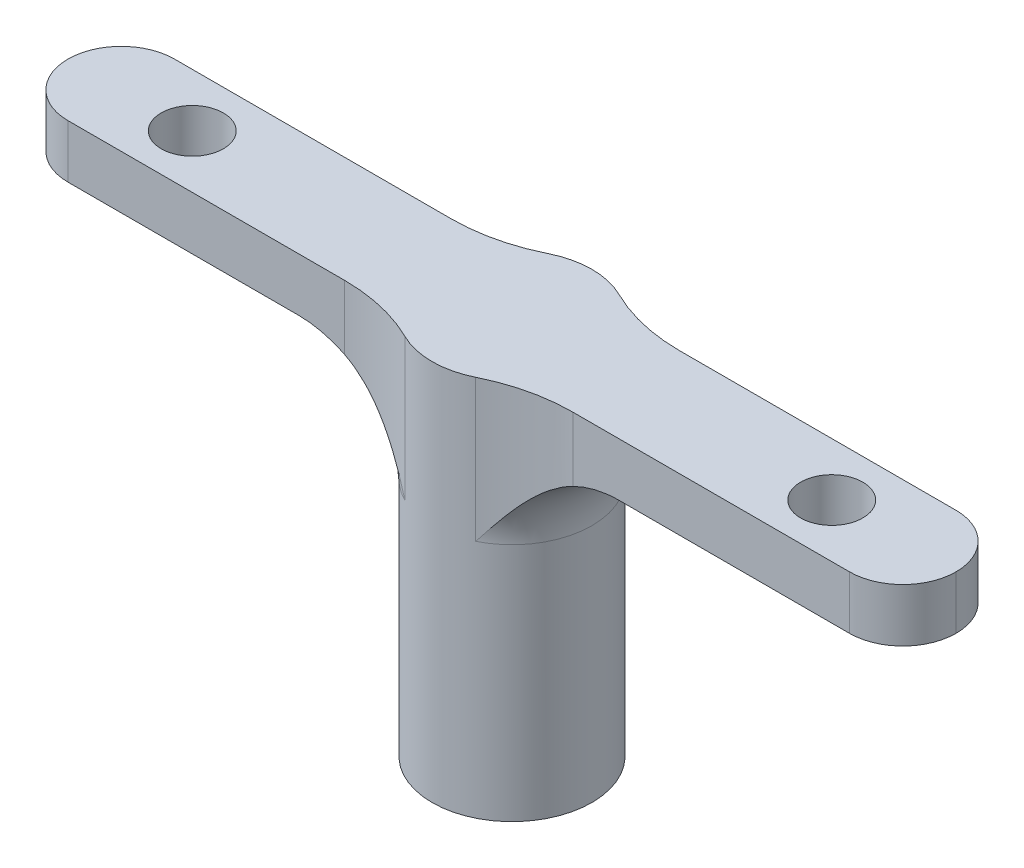
ISO-10303-21;
HEADER;
FILE_DESCRIPTION(('STEP AP214'),'2;1');
FILE_NAME('part.step','',(''),(''),'','','');
FILE_SCHEMA(('AUTOMOTIVE_DESIGN { 1 0 10303 214 1 1 1 1 }'));
ENDSEC;
DATA;
#1=APPLICATION_CONTEXT('core data for automotive mechanical design processes');
#2=APPLICATION_PROTOCOL_DEFINITION('international standard','automotive_design',2000,#1);
#3=PRODUCT_CONTEXT('',#1,'mechanical');
#4=PRODUCT('Part','Part','',(#3));
#5=PRODUCT_RELATED_PRODUCT_CATEGORY('part','',(#4));
#6=PRODUCT_DEFINITION_FORMATION('','',#4);
#7=PRODUCT_DEFINITION_CONTEXT('part definition',#1,'design');
#8=PRODUCT_DEFINITION('design','',#6,#7);
#9=PRODUCT_DEFINITION_SHAPE('','',#8);
#10=(LENGTH_UNIT() NAMED_UNIT(*) SI_UNIT(.MILLI.,.METRE.));
#11=(NAMED_UNIT(*) PLANE_ANGLE_UNIT() SI_UNIT($,.RADIAN.));
#12=(NAMED_UNIT(*) SI_UNIT($,.STERADIAN.) SOLID_ANGLE_UNIT());
#13=UNCERTAINTY_MEASURE_WITH_UNIT(LENGTH_MEASURE(1.E-05),#10,'distance_accuracy_value','');
#14=(GEOMETRIC_REPRESENTATION_CONTEXT(3) GLOBAL_UNCERTAINTY_ASSIGNED_CONTEXT((#13)) GLOBAL_UNIT_ASSIGNED_CONTEXT((#10,
#11,#12)) REPRESENTATION_CONTEXT('',''));
#15=CARTESIAN_POINT('',(0.,0.,0.));
#16=DIRECTION('',(0.,0.,1.));
#17=DIRECTION('',(1.,0.,0.));
#18=AXIS2_PLACEMENT_3D('',#15,#16,#17);
#19=CARTESIAN_POINT('',(0.,21.5,0.));
#20=DIRECTION('',(0.,1.,0.));
#21=DIRECTION('',(0.,0.,1.));
#22=AXIS2_PLACEMENT_3D('',#19,#20,#21);
#23=PLANE('',#22);
#24=CARTESIAN_POINT('',(-22.,21.5,0.));
#25=DIRECTION('',(0.,1.,0.));
#26=DIRECTION('',(0.,0.,1.));
#27=AXIS2_PLACEMENT_3D('',#24,#25,#26);
#28=CIRCLE('',#27,3.);
#29=CARTESIAN_POINT('',(-22.,21.5,-3.));
#30=VERTEX_POINT('',#29);
#31=CARTESIAN_POINT('',(-25.,21.5,0.));
#32=VERTEX_POINT('',#31);
#33=EDGE_CURVE('E207',#30,#32,#28,.T.);
#34=ORIENTED_EDGE('',*,*,#33,.T.);
#35=CARTESIAN_POINT('',(-22.,21.5,0.));
#36=DIRECTION('',(0.,1.,0.));
#37=DIRECTION('',(0.,0.,1.));
#38=AXIS2_PLACEMENT_3D('',#35,#36,#37);
#39=CIRCLE('',#38,3.);
#40=CARTESIAN_POINT('',(-22.,21.5,3.));
#41=VERTEX_POINT('',#40);
#42=EDGE_CURVE('E210',#32,#41,#39,.T.);
#43=ORIENTED_EDGE('',*,*,#42,.T.);
#44=DIRECTION('',(-1.,0.,0.));
#45=VECTOR('',#44,1.);
#46=CARTESIAN_POINT('',(0.,21.5,3.00000000000001));
#47=LINE('',#46,#45);
#48=CARTESIAN_POINT('',(-6.42261628933255,21.5,3.00000000000001));
#49=VERTEX_POINT('',#48);
#50=EDGE_CURVE('E189',#49,#41,#47,.T.);
#51=ORIENTED_EDGE('',*,*,#50,.F.);
#52=CARTESIAN_POINT('',(-6.42261628933255,21.5,13.));
#53=DIRECTION('',(0.,1.,0.));
#54=DIRECTION('',(0.,0.,1.));
#55=AXIS2_PLACEMENT_3D('',#52,#53,#54);
#56=CIRCLE('',#55,10.);
#57=CARTESIAN_POINT('',(-1.99322574496528,21.5,4.03448275862069));
#58=VERTEX_POINT('',#57);
#59=EDGE_CURVE('E388',#49,#58,#56,.F.);
#60=ORIENTED_EDGE('',*,*,#59,.T.);
#61=CARTESIAN_POINT('',(0.,21.5,0.));
#62=DIRECTION('',(0.,1.,0.));
#63=DIRECTION('',(0.,0.,1.));
#64=AXIS2_PLACEMENT_3D('',#61,#62,#63);
#65=CIRCLE('',#64,4.5);
#66=CARTESIAN_POINT('',(1.99322574496527,21.5,4.03448275862069));
#67=VERTEX_POINT('',#66);
#68=EDGE_CURVE('E432',#58,#67,#65,.T.);
#69=ORIENTED_EDGE('',*,*,#68,.T.);
#70=CARTESIAN_POINT('',(6.42261628933255,21.5,13.));
#71=DIRECTION('',(0.,1.,0.));
#72=DIRECTION('',(0.,0.,1.));
#73=AXIS2_PLACEMENT_3D('',#70,#71,#72);
#74=CIRCLE('',#73,10.);
#75=CARTESIAN_POINT('',(6.42261628933255,21.5,3.00000000000001));
#76=VERTEX_POINT('',#75);
#77=EDGE_CURVE('E371',#67,#76,#74,.F.);
#78=ORIENTED_EDGE('',*,*,#77,.T.);
#79=DIRECTION('',(-1.,0.,0.));
#80=VECTOR('',#79,1.);
#81=CARTESIAN_POINT('',(0.,21.5,3.00000000000001));
#82=LINE('',#81,#80);
#83=CARTESIAN_POINT('',(22.,21.5,3.00000000000001));
#84=VERTEX_POINT('',#83);
#85=EDGE_CURVE('E442',#84,#76,#82,.T.);
#86=ORIENTED_EDGE('',*,*,#85,.F.);
#87=CARTESIAN_POINT('',(22.,21.5,0.));
#88=DIRECTION('',(0.,1.,0.));
#89=DIRECTION('',(0.,0.,1.));
#90=AXIS2_PLACEMENT_3D('',#87,#88,#89);
#91=CIRCLE('',#90,3.);
#92=CARTESIAN_POINT('',(25.,21.5,0.));
#93=VERTEX_POINT('',#92);
#94=EDGE_CURVE('E204',#84,#93,#91,.T.);
#95=ORIENTED_EDGE('',*,*,#94,.T.);
#96=CARTESIAN_POINT('',(22.,21.5,0.));
#97=DIRECTION('',(0.,1.,0.));
#98=DIRECTION('',(0.,0.,1.));
#99=AXIS2_PLACEMENT_3D('',#96,#97,#98);
#100=CIRCLE('',#99,3.);
#101=CARTESIAN_POINT('',(22.,21.5,-3.00000000000001));
#102=VERTEX_POINT('',#101);
#103=EDGE_CURVE('E184',#93,#102,#100,.T.);
#104=ORIENTED_EDGE('',*,*,#103,.T.);
#105=DIRECTION('',(-1.,0.,0.));
#106=VECTOR('',#105,1.);
#107=CARTESIAN_POINT('',(0.,21.5,-3.00000000000001));
#108=LINE('',#107,#106);
#109=CARTESIAN_POINT('',(6.42261628933255,21.5,-3.00000000000001));
#110=VERTEX_POINT('',#109);
#111=EDGE_CURVE('E446',#102,#110,#108,.T.);
#112=ORIENTED_EDGE('',*,*,#111,.T.);
#113=CARTESIAN_POINT('',(6.42261628933255,21.5,-13.));
#114=DIRECTION('',(0.,1.,0.));
#115=DIRECTION('',(0.,0.,1.));
#116=AXIS2_PLACEMENT_3D('',#113,#114,#115);
#117=CIRCLE('',#116,10.);
#118=CARTESIAN_POINT('',(1.99322574496527,21.5,-4.03448275862069));
#119=VERTEX_POINT('',#118);
#120=EDGE_CURVE('E359',#110,#119,#117,.F.);
#121=ORIENTED_EDGE('',*,*,#120,.T.);
#122=CARTESIAN_POINT('',(0.,21.5,0.));
#123=DIRECTION('',(0.,1.,0.));
#124=DIRECTION('',(0.,0.,1.));
#125=AXIS2_PLACEMENT_3D('',#122,#123,#124);
#126=CIRCLE('',#125,4.5);
#127=CARTESIAN_POINT('',(-1.99322574496528,21.5,-4.03448275862069));
#128=VERTEX_POINT('',#127);
#129=EDGE_CURVE('E450',#119,#128,#126,.T.);
#130=ORIENTED_EDGE('',*,*,#129,.T.);
#131=CARTESIAN_POINT('',(-6.42261628933255,21.5,-13.));
#132=DIRECTION('',(0.,1.,0.));
#133=DIRECTION('',(0.,0.,1.));
#134=AXIS2_PLACEMENT_3D('',#131,#132,#133);
#135=CIRCLE('',#134,10.);
#136=CARTESIAN_POINT('',(-6.42261628933255,21.5,-3.00000000000001));
#137=VERTEX_POINT('',#136);
#138=EDGE_CURVE('E11',#128,#137,#135,.F.);
#139=ORIENTED_EDGE('',*,*,#138,.T.);
#140=DIRECTION('',(-1.,0.,0.));
#141=VECTOR('',#140,1.);
#142=CARTESIAN_POINT('',(0.,21.5,-3.00000000000001));
#143=LINE('',#142,#141);
#144=EDGE_CURVE('E424',#137,#30,#143,.T.);
#145=ORIENTED_EDGE('',*,*,#144,.T.);
#146=EDGE_LOOP('',(#34,#43,#51,#60,#69,#78,#86,#95,#104,#112,#121,#130,#139,#145));
#147=FACE_BOUND('',#146,.T.);
#148=CARTESIAN_POINT('',(18.,21.5,0.));
#149=DIRECTION('',(0.,1.,0.));
#150=DIRECTION('',(0.,0.,1.));
#151=AXIS2_PLACEMENT_3D('',#148,#149,#150);
#152=CIRCLE('',#151,1.75);
#153=CARTESIAN_POINT('',(18.,21.5,1.75));
#154=VERTEX_POINT('',#153);
#155=EDGE_CURVE('E724',#154,#154,#152,.T.);
#156=ORIENTED_EDGE('',*,*,#155,.F.);
#157=EDGE_LOOP('',(#156));
#158=FACE_BOUND('',#157,.T.);
#159=CARTESIAN_POINT('',(-18.,21.5,0.));
#160=DIRECTION('',(0.,1.,0.));
#161=DIRECTION('',(0.,0.,1.));
#162=AXIS2_PLACEMENT_3D('',#159,#160,#161);
#163=CIRCLE('',#162,1.75);
#164=CARTESIAN_POINT('',(-18.,21.5,1.75));
#165=VERTEX_POINT('',#164);
#166=EDGE_CURVE('E719',#165,#165,#163,.F.);
#167=ORIENTED_EDGE('',*,*,#166,.T.);
#168=EDGE_LOOP('',(#167));
#169=FACE_BOUND('',#168,.T.);
#170=ADVANCED_FACE('F44',(#147,#158,#169),#23,.T.);
#171=CARTESIAN_POINT('',(0.,18.5,0.));
#172=DIRECTION('',(0.,-1.,0.));
#173=DIRECTION('',(0.,0.,-1.));
#174=AXIS2_PLACEMENT_3D('',#171,#172,#173);
#175=CYLINDRICAL_SURFACE('',#174,4.5);
#176=ORIENTED_EDGE('',*,*,#129,.F.);
#177=DIRECTION('',(0.,-1.,0.));
#178=VECTOR('',#177,1.);
#179=CARTESIAN_POINT('',(1.99322574496527,18.5,-4.03448275862069));
#180=LINE('',#179,#178);
#181=CARTESIAN_POINT('',(1.99322574496527,13.5,-4.03448275862069));
#182=VERTEX_POINT('',#181);
#183=EDGE_CURVE('E410',#119,#182,#180,.T.);
#184=ORIENTED_EDGE('',*,*,#183,.T.);
#185=CARTESIAN_POINT('',(0.,13.5,0.));
#186=DIRECTION('',(0.,1.,0.));
#187=DIRECTION('',(0.,0.,1.));
#188=AXIS2_PLACEMENT_3D('',#185,#186,#187);
#189=CIRCLE('',#188,4.5);
#190=CARTESIAN_POINT('',(1.99322574496527,13.5,4.03448275862069));
#191=VERTEX_POINT('',#190);
#192=EDGE_CURVE('E239',#182,#191,#189,.F.);
#193=ORIENTED_EDGE('',*,*,#192,.T.);
#194=DIRECTION('',(0.,-1.,0.));
#195=VECTOR('',#194,1.);
#196=CARTESIAN_POINT('',(1.99322574496527,18.5,4.03448275862069));
#197=LINE('',#196,#195);
#198=EDGE_CURVE('E405',#191,#67,#197,.F.);
#199=ORIENTED_EDGE('',*,*,#198,.T.);
#200=ORIENTED_EDGE('',*,*,#68,.F.);
#201=DIRECTION('',(0.,-1.,0.));
#202=VECTOR('',#201,1.);
#203=CARTESIAN_POINT('',(-1.99322574496528,18.5,4.03448275862069));
#204=LINE('',#203,#202);
#205=CARTESIAN_POINT('',(-1.99322574496528,13.5,4.03448275862069));
#206=VERTEX_POINT('',#205);
#207=EDGE_CURVE('E401',#58,#206,#204,.T.);
#208=ORIENTED_EDGE('',*,*,#207,.T.);
#209=CARTESIAN_POINT('',(0.,13.5,0.));
#210=DIRECTION('',(0.,1.,0.));
#211=DIRECTION('',(0.,0.,1.));
#212=AXIS2_PLACEMENT_3D('',#209,#210,#211);
#213=CIRCLE('',#212,4.5);
#214=CARTESIAN_POINT('',(-1.99322574496528,13.5,-4.03448275862069));
#215=VERTEX_POINT('',#214);
#216=EDGE_CURVE('E242',#206,#215,#213,.F.);
#217=ORIENTED_EDGE('',*,*,#216,.T.);
#218=DIRECTION('',(0.,-1.,0.));
#219=VECTOR('',#218,1.);
#220=CARTESIAN_POINT('',(-1.99322574496528,18.5,-4.03448275862069));
#221=LINE('',#220,#219);
#222=EDGE_CURVE('E398',#215,#128,#221,.F.);
#223=ORIENTED_EDGE('',*,*,#222,.T.);
#224=EDGE_LOOP('',(#176,#184,#193,#199,#200,#208,#217,#223));
#225=FACE_BOUND('',#224,.T.);
#226=CARTESIAN_POINT('',(0.,0.,0.));
#227=DIRECTION('',(0.,1.,0.));
#228=DIRECTION('',(0.,0.,1.));
#229=AXIS2_PLACEMENT_3D('',#226,#227,#228);
#230=CIRCLE('',#229,4.5);
#231=CARTESIAN_POINT('',(0.,0.,4.5));
#232=VERTEX_POINT('',#231);
#233=EDGE_CURVE('E198',#232,#232,#230,.T.);
#234=ORIENTED_EDGE('',*,*,#233,.T.);
#235=EDGE_LOOP('',(#234));
#236=FACE_BOUND('',#235,.T.);
#237=ADVANCED_FACE('F288',(#225,#236),#175,.T.);
#238=CARTESIAN_POINT('',(0.,18.5,0.));
#239=DIRECTION('',(0.,-1.,0.));
#240=DIRECTION('',(0.,0.,-1.));
#241=AXIS2_PLACEMENT_3D('',#238,#239,#240);
#242=CYLINDRICAL_SURFACE('',#241,3.);
#243=CARTESIAN_POINT('',(0.,18.5,0.));
#244=DIRECTION('',(0.,1.,0.));
#245=DIRECTION('',(0.,0.,1.));
#246=AXIS2_PLACEMENT_3D('',#243,#244,#245);
#247=CIRCLE('',#246,3.);
#248=CARTESIAN_POINT('',(0.,18.5,3.));
#249=VERTEX_POINT('',#248);
#250=EDGE_CURVE('E453',#249,#249,#247,.T.);
#251=ORIENTED_EDGE('',*,*,#250,.T.);
#252=EDGE_LOOP('',(#251));
#253=FACE_BOUND('',#252,.T.);
#254=CARTESIAN_POINT('',(0.,0.,0.));
#255=DIRECTION('',(0.,1.,0.));
#256=DIRECTION('',(0.,0.,1.));
#257=AXIS2_PLACEMENT_3D('',#254,#255,#256);
#258=CIRCLE('',#257,3.);
#259=CARTESIAN_POINT('',(0.,0.,3.));
#260=VERTEX_POINT('',#259);
#261=EDGE_CURVE('E192',#260,#260,#258,.T.);
#262=ORIENTED_EDGE('',*,*,#261,.F.);
#263=EDGE_LOOP('',(#262));
#264=FACE_BOUND('',#263,.T.);
#265=ADVANCED_FACE('F284',(#253,#264),#242,.F.);
#266=CARTESIAN_POINT('',(0.,0.,0.));
#267=DIRECTION('',(0.,1.,0.));
#268=DIRECTION('',(0.,0.,1.));
#269=AXIS2_PLACEMENT_3D('',#266,#267,#268);
#270=PLANE('',#269);
#271=ORIENTED_EDGE('',*,*,#233,.F.);
#272=EDGE_LOOP('',(#271));
#273=FACE_BOUND('',#272,.T.);
#274=ORIENTED_EDGE('',*,*,#261,.T.);
#275=EDGE_LOOP('',(#274));
#276=FACE_BOUND('',#275,.T.);
#277=ADVANCED_FACE('F280',(#273,#276),#270,.F.);
#278=CARTESIAN_POINT('',(0.,18.5,0.));
#279=DIRECTION('',(0.,1.,0.));
#280=DIRECTION('',(0.,0.,1.));
#281=AXIS2_PLACEMENT_3D('',#278,#279,#280);
#282=PLANE('',#281);
#283=ORIENTED_EDGE('',*,*,#250,.F.);
#284=EDGE_LOOP('',(#283));
#285=FACE_BOUND('',#284,.T.);
#286=ADVANCED_FACE('F283',(#285),#282,.F.);
#287=CARTESIAN_POINT('',(18.,18.5,0.));
#288=DIRECTION('',(0.,1.,0.));
#289=DIRECTION('',(0.,0.,1.));
#290=AXIS2_PLACEMENT_3D('',#287,#288,#289);
#291=CIRCLE('',#290,1.75);
#292=CARTESIAN_POINT('',(18.,18.5,1.75));
#293=VERTEX_POINT('',#292);
#294=EDGE_CURVE('E716',#293,#293,#291,.T.);
#295=ORIENTED_EDGE('',*,*,#294,.T.);
#296=EDGE_LOOP('',(#295));
#297=FACE_BOUND('',#296,.T.);
#298=DIRECTION('',(-1.,0.,0.));
#299=VECTOR('',#298,1.);
#300=CARTESIAN_POINT('',(0.,18.5,3.00000000000001));
#301=LINE('',#300,#299);
#302=CARTESIAN_POINT('',(22.,18.5,3.00000000000001));
#303=VERTEX_POINT('',#302);
#304=CARTESIAN_POINT('',(9.01387818865997,18.5,3.00000000000001));
#305=VERTEX_POINT('',#304);
#306=EDGE_CURVE('E172',#303,#305,#301,.T.);
#307=ORIENTED_EDGE('',*,*,#306,.T.);
#308=CARTESIAN_POINT('',(0.,18.5,0.));
#309=DIRECTION('',(0.,1.,0.));
#310=DIRECTION('',(0.,0.,1.));
#311=AXIS2_PLACEMENT_3D('',#308,#309,#310);
#312=CIRCLE('',#311,9.5);
#313=CARTESIAN_POINT('',(9.01387818865997,18.5,-3.00000000000001));
#314=VERTEX_POINT('',#313);
#315=EDGE_CURVE('E245',#305,#314,#312,.T.);
#316=ORIENTED_EDGE('',*,*,#315,.T.);
#317=DIRECTION('',(-1.,0.,0.));
#318=VECTOR('',#317,1.);
#319=CARTESIAN_POINT('',(0.,18.5,-3.00000000000001));
#320=LINE('',#319,#318);
#321=CARTESIAN_POINT('',(22.,18.5,-3.00000000000001));
#322=VERTEX_POINT('',#321);
#323=EDGE_CURVE('E428',#322,#314,#320,.T.);
#324=ORIENTED_EDGE('',*,*,#323,.F.);
#325=CARTESIAN_POINT('',(22.,18.5,0.));
#326=DIRECTION('',(0.,1.,0.));
#327=DIRECTION('',(0.,0.,1.));
#328=AXIS2_PLACEMENT_3D('',#325,#326,#327);
#329=CIRCLE('',#328,3.);
#330=CARTESIAN_POINT('',(25.,18.5,0.));
#331=VERTEX_POINT('',#330);
#332=EDGE_CURVE('E217',#322,#331,#329,.F.);
#333=ORIENTED_EDGE('',*,*,#332,.T.);
#334=CARTESIAN_POINT('',(22.,18.5,0.));
#335=DIRECTION('',(0.,1.,0.));
#336=DIRECTION('',(0.,0.,1.));
#337=AXIS2_PLACEMENT_3D('',#334,#335,#336);
#338=CIRCLE('',#337,3.);
#339=EDGE_CURVE('E220',#331,#303,#338,.F.);
#340=ORIENTED_EDGE('',*,*,#339,.T.);
#341=EDGE_LOOP('',(#307,#316,#324,#333,#340));
#342=FACE_BOUND('',#341,.T.);
#343=ADVANCED_FACE('F319',(#297,#342),#282,.F.);
#344=CARTESIAN_POINT('',(-18.,18.5,0.));
#345=DIRECTION('',(0.,1.,0.));
#346=DIRECTION('',(0.,0.,1.));
#347=AXIS2_PLACEMENT_3D('',#344,#345,#346);
#348=CIRCLE('',#347,1.75);
#349=CARTESIAN_POINT('',(-18.,18.5,1.75));
#350=VERTEX_POINT('',#349);
#351=EDGE_CURVE('E236',#350,#350,#348,.F.);
#352=ORIENTED_EDGE('',*,*,#351,.F.);
#353=EDGE_LOOP('',(#352));
#354=FACE_BOUND('',#353,.T.);
#355=DIRECTION('',(-1.,0.,0.));
#356=VECTOR('',#355,1.);
#357=CARTESIAN_POINT('',(0.,18.5,-3.00000000000001));
#358=LINE('',#357,#356);
#359=CARTESIAN_POINT('',(-9.01387818865997,18.5,-3.));
#360=VERTEX_POINT('',#359);
#361=CARTESIAN_POINT('',(-22.,18.5,-3.));
#362=VERTEX_POINT('',#361);
#363=EDGE_CURVE('E173',#360,#362,#358,.T.);
#364=ORIENTED_EDGE('',*,*,#363,.F.);
#365=CARTESIAN_POINT('',(0.,18.5,0.));
#366=DIRECTION('',(0.,1.,0.));
#367=DIRECTION('',(0.,0.,1.));
#368=AXIS2_PLACEMENT_3D('',#365,#366,#367);
#369=CIRCLE('',#368,9.5);
#370=CARTESIAN_POINT('',(-9.01387818865997,18.5,3.));
#371=VERTEX_POINT('',#370);
#372=EDGE_CURVE('E167',#360,#371,#369,.T.);
#373=ORIENTED_EDGE('',*,*,#372,.T.);
#374=DIRECTION('',(-1.,0.,0.));
#375=VECTOR('',#374,1.);
#376=CARTESIAN_POINT('',(0.,18.5,3.00000000000001));
#377=LINE('',#376,#375);
#378=CARTESIAN_POINT('',(-22.,18.5,3.));
#379=VERTEX_POINT('',#378);
#380=EDGE_CURVE('E159',#371,#379,#377,.T.);
#381=ORIENTED_EDGE('',*,*,#380,.T.);
#382=CARTESIAN_POINT('',(-22.,18.5,0.));
#383=DIRECTION('',(0.,1.,0.));
#384=DIRECTION('',(0.,0.,1.));
#385=AXIS2_PLACEMENT_3D('',#382,#383,#384);
#386=CIRCLE('',#385,3.);
#387=CARTESIAN_POINT('',(-25.,18.5,0.));
#388=VERTEX_POINT('',#387);
#389=EDGE_CURVE('E164',#379,#388,#386,.F.);
#390=ORIENTED_EDGE('',*,*,#389,.T.);
#391=CARTESIAN_POINT('',(-22.,18.5,0.));
#392=DIRECTION('',(0.,1.,0.));
#393=DIRECTION('',(0.,0.,1.));
#394=AXIS2_PLACEMENT_3D('',#391,#392,#393);
#395=CIRCLE('',#394,3.);
#396=EDGE_CURVE('E185',#388,#362,#395,.F.);
#397=ORIENTED_EDGE('',*,*,#396,.T.);
#398=EDGE_LOOP('',(#364,#373,#381,#390,#397));
#399=FACE_BOUND('',#398,.T.);
#400=ADVANCED_FACE('F162',(#354,#399),#282,.F.);
#401=CARTESIAN_POINT('',(0.,21.5,-3.00000000000001));
#402=DIRECTION('',(0.,0.,1.));
#403=DIRECTION('',(1.,0.,0.));
#404=AXIS2_PLACEMENT_3D('',#401,#402,#403);
#405=PLANE('',#404);
#406=ORIENTED_EDGE('',*,*,#144,.F.);
#407=DIRECTION('',(0.,1.,0.));
#408=VECTOR('',#407,1.);
#409=CARTESIAN_POINT('',(-6.42261628933255,13.5,-3.00000000000001));
#410=LINE('',#409,#408);
#411=CARTESIAN_POINT('',(-6.42261628933255,17.8801535758691,-3.00000000000001));
#412=VERTEX_POINT('',#411);
#413=EDGE_CURVE('E360',#137,#412,#410,.F.);
#414=ORIENTED_EDGE('',*,*,#413,.T.);
#415=CARTESIAN_POINT('',(-3.35410196624968,13.5,-3.00000000000001));
#416=CARTESIAN_POINT('',(-3.35409939555844,13.5600812263916,-3.00000000000001));
#417=CARTESIAN_POINT('',(-3.35555540128756,13.6201527571186,-3.00000000000001));
#418=CARTESIAN_POINT('',(-3.3613573350933,13.7401505168698,-3.00000000000001));
#419=CARTESIAN_POINT('',(-3.36570298723526,13.8000767592194,-3.00000000000001));
#420=CARTESIAN_POINT('',(-3.38301667702552,13.979286679598,-3.00000000000001));
#421=CARTESIAN_POINT('',(-3.40026161559578,14.0981823734233,-3.00000000000001));
#422=CARTESIAN_POINT('',(-3.44539553092028,14.3327844887415,-3.00000000000001));
#423=CARTESIAN_POINT('',(-3.47318697871367,14.4485100151797,-3.00000000000001));
#424=CARTESIAN_POINT('',(-3.53864831275722,14.6771536990862,-3.00000000000001));
#425=CARTESIAN_POINT('',(-3.57632097910554,14.7900710566671,-3.00000000000001));
#426=CARTESIAN_POINT('',(-3.66045002267836,15.0119077235751,-3.00000000000001));
#427=CARTESIAN_POINT('',(-3.70686050055317,15.1208445239951,-3.00000000000001));
#428=CARTESIAN_POINT('',(-3.80772743309339,15.3348872044491,-3.00000000000001));
#429=CARTESIAN_POINT('',(-3.8621834588133,15.4399932883442,-3.00000000000001));
#430=CARTESIAN_POINT('',(-4.03674018643422,15.7496449450745,-3.00000000000001));
#431=CARTESIAN_POINT('',(-4.16784826634644,15.9480604271268,-3.00000000000001));
#432=CARTESIAN_POINT('',(-4.47908104564637,16.3595480903214,-3.00000000000001));
#433=CARTESIAN_POINT('',(-4.66376631044919,16.5691453869052,-3.00000000000001));
#434=CARTESIAN_POINT('',(-5.06033146637108,16.9605999524586,-3.00000000000001));
#435=CARTESIAN_POINT('',(-5.27221428064687,17.1424542350411,-3.00000000000001));
#436=CARTESIAN_POINT('',(-5.76234239213647,17.5082083043523,-3.00000000000001));
#437=CARTESIAN_POINT('',(-6.04548436642661,17.6856467476321,-3.00000000000001));
#438=CARTESIAN_POINT('',(-6.4887353878357,17.9151750252235,-3.00000000000001));
#439=CARTESIAN_POINT('',(-6.63964174511769,17.9856011216164,-3.00000000000001));
#440=CARTESIAN_POINT('',(-6.94676887926378,18.1136577315292,-3.00000000000001));
#441=CARTESIAN_POINT('',(-7.10298717909501,18.171294117208,-3.00000000000001));
#442=CARTESIAN_POINT('',(-7.40260102139487,18.2676616075375,-3.00000000000001));
#443=CARTESIAN_POINT('',(-7.5455587646451,18.3077623742237,-3.00000000000001));
#444=CARTESIAN_POINT('',(-7.83411189632379,18.3769155117469,-3.00000000000001));
#445=CARTESIAN_POINT('',(-7.97970692018281,18.4059693976419,-3.00000000000001));
#446=CARTESIAN_POINT('',(-8.27290030061913,18.4527102510171,-3.00000000000001));
#447=CARTESIAN_POINT('',(-8.42050091663214,18.4703830846257,-3.00000000000001));
#448=CARTESIAN_POINT('',(-8.71668746370025,18.4940364335158,-3.00000000000001));
#449=CARTESIAN_POINT('',(-8.86527373358701,18.5000126940052,-3.00000000000001));
#450=CARTESIAN_POINT('',(-9.01387818865997,18.5,-3.));
#451=B_SPLINE_CURVE_WITH_KNOTS('',3,(#415,#416,#417,#418,#419,#420,#421,#422,#423,#424,#425,
#426,#427,#428,#429,#430,#431,#432,#433,#434,#435,#436,#437,#438,#439,#440,#441,#442,#443,#444,
#445,#446,#447,#448,#449,#450),.UNSPECIFIED.,.F.,.F.,(4,2,2,2,2,2,2,2,2,2,2,2,2,2,2,2,2,4),(0.,
0.180207120818137,0.360397035984692,0.720236666161326,1.07682671034614,1.43351718958414,
1.78838377937391,2.14323145640175,2.85440571824387,3.6895583648159,4.52480084776828,
5.52224977620202,6.02138783021814,6.52029623788583,6.96530997764097,7.41026266259424,
7.85576686401964,8.30143309372746),.UNSPECIFIED.);
#452=EDGE_CURVE('E258',#412,#360,#451,.T.);
#453=ORIENTED_EDGE('',*,*,#452,.T.);
#454=ORIENTED_EDGE('',*,*,#363,.T.);
#455=DIRECTION('',(0.,-1.,0.));
#456=VECTOR('',#455,1.);
#457=CARTESIAN_POINT('',(-22.,21.5,-3.));
#458=LINE('',#457,#456);
#459=EDGE_CURVE('E213',#362,#30,#458,.F.);
#460=ORIENTED_EDGE('',*,*,#459,.T.);
#461=EDGE_LOOP('',(#406,#414,#453,#454,#460));
#462=FACE_BOUND('',#461,.T.);
#463=ADVANCED_FACE('F273',(#462),#405,.F.);
#464=CARTESIAN_POINT('',(0.,21.5,3.00000000000001));
#465=DIRECTION('',(0.,0.,1.));
#466=DIRECTION('',(1.,0.,0.));
#467=AXIS2_PLACEMENT_3D('',#464,#465,#466);
#468=PLANE('',#467);
#469=CARTESIAN_POINT('',(-9.01387818865997,18.5,3.));
#470=CARTESIAN_POINT('',(-8.85077958790054,18.5000171549488,3.00000000000001));
#471=CARTESIAN_POINT('',(-8.68771036180899,18.4928162946358,3.00000000000001));
#472=CARTESIAN_POINT('',(-8.36286390717752,18.4643528344453,3.00000000000001));
#473=CARTESIAN_POINT('',(-8.20108620059187,18.4430957072979,3.00000000000001));
#474=CARTESIAN_POINT('',(-7.88049658702383,18.3869930688253,3.00000000000001));
#475=CARTESIAN_POINT('',(-7.72167619879797,18.3521959996033,3.00000000000001));
#476=CARTESIAN_POINT('',(-7.40751080552299,18.2695068939798,3.00000000000001));
#477=CARTESIAN_POINT('',(-7.25216607882841,18.2216138127932,3.00000000000001));
#478=CARTESIAN_POINT('',(-6.79325671136647,18.0591974215227,3.00000000000001));
#479=CARTESIAN_POINT('',(-6.49616269016707,17.9258198927066,3.00000000000001));
#480=CARTESIAN_POINT('',(-5.92660231577185,17.6133063727477,3.00000000000001));
#481=CARTESIAN_POINT('',(-5.65417370600625,17.4341018068004,3.));
#482=CARTESIAN_POINT('',(-5.26299317203683,17.1297310626444,3.00000000000001));
#483=CARTESIAN_POINT('',(-5.132611437191,17.0192189348607,3.00000000000001));
#484=CARTESIAN_POINT('',(-4.88162725885214,16.7874997146426,3.00000000000001));
#485=CARTESIAN_POINT('',(-4.76102639253828,16.6662909039067,3.00000000000001));
#486=CARTESIAN_POINT('',(-4.53090215756267,16.413851105325,3.00000000000001));
#487=CARTESIAN_POINT('',(-4.42137372821982,16.2826247445975,3.00000000000001));
#488=CARTESIAN_POINT('',(-4.21484191234694,16.0107769838205,3.00000000000001));
#489=CARTESIAN_POINT('',(-4.11783354640181,15.8701593527941,3.00000000000001));
#490=CARTESIAN_POINT('',(-3.89862126389076,15.5163382647414,3.00000000000001));
#491=CARTESIAN_POINT('',(-3.78396235663988,15.298293648913,3.00000000000001));
#492=CARTESIAN_POINT('',(-3.63950073167345,14.960085377771,3.00000000000001));
#493=CARTESIAN_POINT('',(-3.59597513943966,14.8456552181967,3.00000000000001));
#494=CARTESIAN_POINT('',(-3.51892702448666,14.6134910717233,3.00000000000001));
#495=CARTESIAN_POINT('',(-3.48540077816579,14.4957583325667,3.00000000000001));
#496=CARTESIAN_POINT('',(-3.42355721896762,14.233441112998,3.00000000000001));
#497=CARTESIAN_POINT('',(-3.39768395825079,14.0882630103409,3.00000000000001));
#498=CARTESIAN_POINT('',(-3.37162735107277,13.868793062307,3.00000000000001));
#499=CARTESIAN_POINT('',(-3.3650671071166,13.7952114703037,3.00000000000001));
#500=CARTESIAN_POINT('',(-3.35630062770966,13.6477597550173,3.00000000000001));
#501=CARTESIAN_POINT('',(-3.35409616746153,13.573889526384,3.00000000000001));
#502=CARTESIAN_POINT('',(-3.35410196624968,13.5,3.00000000000001));
#503=B_SPLINE_CURVE_WITH_KNOTS('',3,(#469,#470,#471,#472,#473,#474,#475,#476,#477,#478,#479,
#480,#481,#482,#483,#484,#485,#486,#487,#488,#489,#490,#491,#492,#493,#494,#495,#496,#497,#498,
#499,#500,#501,#502),.UNSPECIFIED.,.F.,.F.,(4,2,2,2,2,2,2,2,2,2,2,2,2,2,2,2,4),(0.,
0.48909185676179,0.977993400339365,1.46516164054013,1.95236875782028,2.92481361308318,
3.89872222130378,4.41095375468172,4.92326772258132,5.4353464674561,5.9472209192594,
6.68304091684271,7.04995631725654,7.41673491296898,7.85806804057888,8.07957620908157,
8.30117463478584),.UNSPECIFIED.);
#504=CARTESIAN_POINT('',(-6.4226162893293,17.8801535758675,3.00000000000001));
#505=VERTEX_POINT('',#504);
#506=EDGE_CURVE('E249',#371,#505,#503,.T.);
#507=ORIENTED_EDGE('',*,*,#506,.T.);
#508=DIRECTION('',(0.,-1.,0.));
#509=VECTOR('',#508,1.);
#510=CARTESIAN_POINT('',(-6.42261628933255,21.5,3.00000000000001));
#511=LINE('',#510,#509);
#512=EDGE_CURVE('E420',#505,#49,#511,.F.);
#513=ORIENTED_EDGE('',*,*,#512,.T.);
#514=ORIENTED_EDGE('',*,*,#50,.T.);
#515=DIRECTION('',(0.,-1.,0.));
#516=VECTOR('',#515,1.);
#517=CARTESIAN_POINT('',(-22.,18.5,3.));
#518=LINE('',#517,#516);
#519=EDGE_CURVE('E180',#41,#379,#518,.T.);
#520=ORIENTED_EDGE('',*,*,#519,.T.);
#521=ORIENTED_EDGE('',*,*,#380,.F.);
#522=EDGE_LOOP('',(#507,#513,#514,#520,#521));
#523=FACE_BOUND('',#522,.T.);
#524=ADVANCED_FACE('F187',(#523),#468,.T.);
#525=CARTESIAN_POINT('',(0.,21.5,3.00000000000001));
#526=DIRECTION('',(0.,0.,1.));
#527=DIRECTION('',(1.,0.,0.));
#528=AXIS2_PLACEMENT_3D('',#525,#526,#527);
#529=PLANE('',#528);
#530=ORIENTED_EDGE('',*,*,#85,.T.);
#531=DIRECTION('',(0.,-1.,0.));
#532=VECTOR('',#531,1.);
#533=CARTESIAN_POINT('',(6.42261628933255,21.5,3.00000000000001));
#534=LINE('',#533,#532);
#535=CARTESIAN_POINT('',(6.42261628933255,17.8801535758691,3.00000000000001));
#536=VERTEX_POINT('',#535);
#537=EDGE_CURVE('E417',#76,#536,#534,.T.);
#538=ORIENTED_EDGE('',*,*,#537,.T.);
#539=CARTESIAN_POINT('',(3.35410196624968,13.5,3.00000000000001));
#540=CARTESIAN_POINT('',(3.35409939555844,13.5600812263916,3.00000000000001));
#541=CARTESIAN_POINT('',(3.35555540128756,13.6201527571186,3.00000000000001));
#542=CARTESIAN_POINT('',(3.3613573350933,13.7401505168698,3.00000000000001));
#543=CARTESIAN_POINT('',(3.36570298723526,13.8000767592194,3.00000000000001));
#544=CARTESIAN_POINT('',(3.38301667702552,13.979286679598,3.00000000000001));
#545=CARTESIAN_POINT('',(3.40026161559577,14.0981823734233,3.00000000000001));
#546=CARTESIAN_POINT('',(3.44539553092028,14.3327844887415,3.00000000000001));
#547=CARTESIAN_POINT('',(3.47318697871367,14.4485100151797,3.00000000000001));
#548=CARTESIAN_POINT('',(3.53864831275722,14.6771536990862,3.00000000000001));
#549=CARTESIAN_POINT('',(3.57632097910554,14.7900710566671,3.00000000000001));
#550=CARTESIAN_POINT('',(3.66045002267836,15.0119077235751,3.00000000000001));
#551=CARTESIAN_POINT('',(3.70686050055317,15.1208445239951,3.00000000000001));
#552=CARTESIAN_POINT('',(3.80772743309339,15.3348872044491,3.00000000000001));
#553=CARTESIAN_POINT('',(3.8621834588133,15.4399932883442,3.00000000000001));
#554=CARTESIAN_POINT('',(4.03674018643422,15.7496449450745,3.00000000000001));
#555=CARTESIAN_POINT('',(4.16784826634644,15.9480604271268,3.00000000000001));
#556=CARTESIAN_POINT('',(4.47908104564638,16.3595480903214,3.00000000000001));
#557=CARTESIAN_POINT('',(4.66376631044919,16.5691453869052,3.00000000000001));
#558=CARTESIAN_POINT('',(5.06033146637108,16.9605999524586,3.00000000000001));
#559=CARTESIAN_POINT('',(5.27221428064687,17.1424542350411,3.00000000000001));
#560=CARTESIAN_POINT('',(5.76234239213647,17.5082083043523,3.00000000000001));
#561=CARTESIAN_POINT('',(6.04548436642661,17.6856467476321,3.00000000000001));
#562=CARTESIAN_POINT('',(6.4887353878357,17.9151750252235,3.00000000000001));
#563=CARTESIAN_POINT('',(6.63964174511769,17.9856011216164,3.00000000000001));
#564=CARTESIAN_POINT('',(6.94676887926378,18.1136577315292,3.00000000000001));
#565=CARTESIAN_POINT('',(7.10298717909501,18.171294117208,3.00000000000001));
#566=CARTESIAN_POINT('',(7.40260102139487,18.2676616075375,3.00000000000001));
#567=CARTESIAN_POINT('',(7.5455587646451,18.3077623742237,3.00000000000001));
#568=CARTESIAN_POINT('',(7.83411189632379,18.3769155117469,3.00000000000001));
#569=CARTESIAN_POINT('',(7.97970692018281,18.4059693976419,3.00000000000001));
#570=CARTESIAN_POINT('',(8.27290030061914,18.4527102510171,3.00000000000001));
#571=CARTESIAN_POINT('',(8.42050091663214,18.4703830846257,3.00000000000001));
#572=CARTESIAN_POINT('',(8.71668746370025,18.4940364335158,3.00000000000001));
#573=CARTESIAN_POINT('',(8.86527373358701,18.5000126940052,3.00000000000001));
#574=CARTESIAN_POINT('',(9.01387818865997,18.5,3.00000000000001));
#575=B_SPLINE_CURVE_WITH_KNOTS('',3,(#539,#540,#541,#542,#543,#544,#545,#546,#547,#548,#549,
#550,#551,#552,#553,#554,#555,#556,#557,#558,#559,#560,#561,#562,#563,#564,#565,#566,#567,#568,
#569,#570,#571,#572,#573,#574),.UNSPECIFIED.,.F.,.F.,(4,2,2,2,2,2,2,2,2,2,2,2,2,2,2,2,2,4),(0.,
0.180207120818137,0.360397035984692,0.720236666161326,1.07682671034614,1.43351718958414,
1.78838377937391,2.14323145640176,2.85440571824387,3.68955836481591,4.52480084776828,
5.52224977620202,6.02138783021815,6.52029623788583,6.96530997764098,7.41026266259424,
7.85576686401965,8.30143309372746),.UNSPECIFIED.);
#576=EDGE_CURVE('E332',#536,#305,#575,.T.);
#577=ORIENTED_EDGE('',*,*,#576,.T.);
#578=ORIENTED_EDGE('',*,*,#306,.F.);
#579=DIRECTION('',(0.,-1.,0.));
#580=VECTOR('',#579,1.);
#581=CARTESIAN_POINT('',(22.,21.5,3.00000000000001));
#582=LINE('',#581,#580);
#583=EDGE_CURVE('E223',#303,#84,#582,.F.);
#584=ORIENTED_EDGE('',*,*,#583,.T.);
#585=EDGE_LOOP('',(#530,#538,#577,#578,#584));
#586=FACE_BOUND('',#585,.T.);
#587=ADVANCED_FACE('F272',(#586),#529,.T.);
#588=CARTESIAN_POINT('',(0.,21.5,-3.00000000000001));
#589=DIRECTION('',(0.,0.,1.));
#590=DIRECTION('',(1.,0.,0.));
#591=AXIS2_PLACEMENT_3D('',#588,#589,#590);
#592=PLANE('',#591);
#593=CARTESIAN_POINT('',(9.01387818865997,18.5,-3.00000000000001));
#594=CARTESIAN_POINT('',(8.85077958790054,18.5000171549488,-3.00000000000001));
#595=CARTESIAN_POINT('',(8.68771036180899,18.4928162946358,-3.00000000000001));
#596=CARTESIAN_POINT('',(8.36286390717752,18.4643528344453,-3.00000000000001));
#597=CARTESIAN_POINT('',(8.20108620059187,18.4430957072979,-3.00000000000001));
#598=CARTESIAN_POINT('',(7.88049658702383,18.3869930688253,-3.00000000000001));
#599=CARTESIAN_POINT('',(7.72167619879797,18.3521959996033,-3.00000000000001));
#600=CARTESIAN_POINT('',(7.40751080552299,18.2695068939798,-3.00000000000001));
#601=CARTESIAN_POINT('',(7.25216607882841,18.2216138127932,-3.00000000000001));
#602=CARTESIAN_POINT('',(6.79325671136647,18.0591974215227,-3.00000000000001));
#603=CARTESIAN_POINT('',(6.49616269016708,17.9258198927066,-3.00000000000001));
#604=CARTESIAN_POINT('',(5.92660231577185,17.6133063727477,-3.00000000000001));
#605=CARTESIAN_POINT('',(5.65417370600625,17.4341018068004,-3.00000000000001));
#606=CARTESIAN_POINT('',(5.26299317203683,17.1297310626444,-3.00000000000001));
#607=CARTESIAN_POINT('',(5.132611437191,17.0192189348607,-3.00000000000001));
#608=CARTESIAN_POINT('',(4.88162725885214,16.7874997146426,-3.00000000000001));
#609=CARTESIAN_POINT('',(4.76102639253827,16.6662909039066,-3.00000000000001));
#610=CARTESIAN_POINT('',(4.53090215756267,16.413851105325,-3.00000000000001));
#611=CARTESIAN_POINT('',(4.42137372821981,16.2826247445975,-3.00000000000001));
#612=CARTESIAN_POINT('',(4.21484191234693,16.0107769838205,-3.00000000000001));
#613=CARTESIAN_POINT('',(4.11783354640181,15.8701593527941,-3.00000000000001));
#614=CARTESIAN_POINT('',(3.89862126389076,15.5163382647414,-3.00000000000001));
#615=CARTESIAN_POINT('',(3.78396235663988,15.298293648913,-3.00000000000001));
#616=CARTESIAN_POINT('',(3.63950073167345,14.960085377771,-3.00000000000001));
#617=CARTESIAN_POINT('',(3.59597513943966,14.8456552181967,-3.00000000000001));
#618=CARTESIAN_POINT('',(3.51892702448666,14.6134910717233,-3.00000000000001));
#619=CARTESIAN_POINT('',(3.48540077816579,14.4957583325667,-3.00000000000001));
#620=CARTESIAN_POINT('',(3.42355721896762,14.233441112998,-3.00000000000001));
#621=CARTESIAN_POINT('',(3.39768395825079,14.0882630103409,-3.00000000000001));
#622=CARTESIAN_POINT('',(3.37162735107277,13.868793062307,-3.00000000000001));
#623=CARTESIAN_POINT('',(3.3650671071166,13.7952114703037,-3.00000000000001));
#624=CARTESIAN_POINT('',(3.35630062770966,13.6477597550173,-3.00000000000001));
#625=CARTESIAN_POINT('',(3.35409616746153,13.573889526384,-3.00000000000001));
#626=CARTESIAN_POINT('',(3.35410196624968,13.5,-3.00000000000001));
#627=B_SPLINE_CURVE_WITH_KNOTS('',3,(#593,#594,#595,#596,#597,#598,#599,#600,#601,#602,#603,
#604,#605,#606,#607,#608,#609,#610,#611,#612,#613,#614,#615,#616,#617,#618,#619,#620,#621,#622,
#623,#624,#625,#626),.UNSPECIFIED.,.F.,.F.,(4,2,2,2,2,2,2,2,2,2,2,2,2,2,2,2,4),(0.,
0.48909185676179,0.977993400339367,1.46516164054013,1.95236875782028,2.92481361308318,
3.89872222130378,4.41095375468173,4.92326772258133,5.4353464674561,5.9472209192594,
6.68304091684271,7.04995631725654,7.41673491296898,7.85806804057888,8.07957620908157,
8.30117463478584),.UNSPECIFIED.);
#628=CARTESIAN_POINT('',(6.4226162893293,17.8801535758675,-3.00000000000001));
#629=VERTEX_POINT('',#628);
#630=EDGE_CURVE('E324',#314,#629,#627,.T.);
#631=ORIENTED_EDGE('',*,*,#630,.T.);
#632=DIRECTION('',(0.,1.,0.));
#633=VECTOR('',#632,1.);
#634=CARTESIAN_POINT('',(6.42261628933255,21.5,-3.00000000000001));
#635=LINE('',#634,#633);
#636=EDGE_CURVE('E414',#629,#110,#635,.T.);
#637=ORIENTED_EDGE('',*,*,#636,.T.);
#638=ORIENTED_EDGE('',*,*,#111,.F.);
#639=DIRECTION('',(0.,-1.,0.));
#640=VECTOR('',#639,1.);
#641=CARTESIAN_POINT('',(22.,18.5,-3.00000000000001));
#642=LINE('',#641,#640);
#643=EDGE_CURVE('E227',#102,#322,#642,.T.);
#644=ORIENTED_EDGE('',*,*,#643,.T.);
#645=ORIENTED_EDGE('',*,*,#323,.T.);
#646=EDGE_LOOP('',(#631,#637,#638,#644,#645));
#647=FACE_BOUND('',#646,.T.);
#648=ADVANCED_FACE('F299',(#647),#592,.F.);
#649=CARTESIAN_POINT('',(-22.,21.5,0.));
#650=DIRECTION('',(0.,-1.,0.));
#651=DIRECTION('',(0.,0.,-1.));
#652=AXIS2_PLACEMENT_3D('',#649,#650,#651);
#653=CYLINDRICAL_SURFACE('',#652,3.);
#654=DIRECTION('',(0.,-1.,0.));
#655=VECTOR('',#654,1.);
#656=CARTESIAN_POINT('',(-25.,21.5,0.));
#657=LINE('',#656,#655);
#658=EDGE_CURVE('E182',#32,#388,#657,.T.);
#659=ORIENTED_EDGE('',*,*,#658,.F.);
#660=ORIENTED_EDGE('',*,*,#33,.F.);
#661=ORIENTED_EDGE('',*,*,#459,.F.);
#662=ORIENTED_EDGE('',*,*,#396,.F.);
#663=EDGE_LOOP('',(#659,#660,#661,#662));
#664=FACE_BOUND('',#663,.T.);
#665=ADVANCED_FACE('F296',(#664),#653,.T.);
#666=CARTESIAN_POINT('',(-22.,21.5,0.));
#667=DIRECTION('',(0.,1.,0.));
#668=DIRECTION('',(0.,0.,1.));
#669=AXIS2_PLACEMENT_3D('',#666,#667,#668);
#670=CYLINDRICAL_SURFACE('',#669,3.);
#671=ORIENTED_EDGE('',*,*,#42,.F.);
#672=ORIENTED_EDGE('',*,*,#658,.T.);
#673=ORIENTED_EDGE('',*,*,#389,.F.);
#674=ORIENTED_EDGE('',*,*,#519,.F.);
#675=EDGE_LOOP('',(#671,#672,#673,#674));
#676=FACE_BOUND('',#675,.T.);
#677=ADVANCED_FACE('F179',(#676),#670,.T.);
#678=CARTESIAN_POINT('',(22.,21.5,0.));
#679=DIRECTION('',(0.,1.,0.));
#680=DIRECTION('',(0.,0.,1.));
#681=AXIS2_PLACEMENT_3D('',#678,#679,#680);
#682=CYLINDRICAL_SURFACE('',#681,3.);
#683=ORIENTED_EDGE('',*,*,#643,.F.);
#684=ORIENTED_EDGE('',*,*,#103,.F.);
#685=DIRECTION('',(0.,-1.,0.));
#686=VECTOR('',#685,1.);
#687=CARTESIAN_POINT('',(25.,21.5,0.));
#688=LINE('',#687,#686);
#689=EDGE_CURVE('E232',#331,#93,#688,.F.);
#690=ORIENTED_EDGE('',*,*,#689,.F.);
#691=ORIENTED_EDGE('',*,*,#332,.F.);
#692=EDGE_LOOP('',(#683,#684,#690,#691));
#693=FACE_BOUND('',#692,.T.);
#694=ADVANCED_FACE('F295',(#693),#682,.T.);
#695=CARTESIAN_POINT('',(22.,21.5,0.));
#696=DIRECTION('',(0.,-1.,0.));
#697=DIRECTION('',(0.,0.,-1.));
#698=AXIS2_PLACEMENT_3D('',#695,#696,#697);
#699=CYLINDRICAL_SURFACE('',#698,3.);
#700=ORIENTED_EDGE('',*,*,#94,.F.);
#701=ORIENTED_EDGE('',*,*,#583,.F.);
#702=ORIENTED_EDGE('',*,*,#339,.F.);
#703=ORIENTED_EDGE('',*,*,#689,.T.);
#704=EDGE_LOOP('',(#700,#701,#702,#703));
#705=FACE_BOUND('',#704,.T.);
#706=ADVANCED_FACE('F301',(#705),#699,.T.);
#707=CARTESIAN_POINT('',(0.,13.5,0.));
#708=DIRECTION('',(0.,1.,0.));
#709=DIRECTION('',(0.,0.,1.));
#710=AXIS2_PLACEMENT_3D('',#707,#708,#709);
#711=TOROIDAL_SURFACE('',#710,9.5,5.);
#712=ORIENTED_EDGE('',*,*,#452,.F.);
#713=CARTESIAN_POINT('',(-6.42261628933255,17.8801535758691,-3.00000000000001));
#714=CARTESIAN_POINT('',(-6.24217819688331,17.7901803415237,-3.00000994897529));
#715=CARTESIAN_POINT('',(-6.0659967515379,17.6921794910871,-3.00488244705308));
#716=CARTESIAN_POINT('',(-5.72282287116473,17.4827028443215,-3.02303724980809));
#717=CARTESIAN_POINT('',(-5.55580972168613,17.3712594107785,-3.03629967046996));
#718=CARTESIAN_POINT('',(-5.23280770877718,17.1384824594539,-3.06972290189661));
#719=CARTESIAN_POINT('',(-5.07670786475061,17.0172886396105,-3.08979617603194));
#720=CARTESIAN_POINT('',(-4.77288502601619,16.7657220890844,-3.13582285136153));
#721=CARTESIAN_POINT('',(-4.62516771589439,16.6353432608102,-3.16178018460967));
#722=CARTESIAN_POINT('',(-4.24165515416797,16.2776920166254,-3.23765998724987));
#723=CARTESIAN_POINT('',(-4.01288365625112,16.0438338147847,-3.29201379085219));
#724=CARTESIAN_POINT('',(-3.57360114914912,15.5622723973905,-3.41172823334759));
#725=CARTESIAN_POINT('',(-3.36310089097535,15.3145611696161,-3.47709528692909));
#726=CARTESIAN_POINT('',(-2.95525319911747,14.809588428806,-3.61788268227715));
#727=CARTESIAN_POINT('',(-2.75796550632916,14.5522907817981,-3.69334459476108));
#728=CARTESIAN_POINT('',(-2.37319840336792,14.0336968764056,-3.85419907606031));
#729=CARTESIAN_POINT('',(-2.18571553941745,13.7724020685271,-3.93958811338994));
#730=CARTESIAN_POINT('',(-1.99845733145479,13.5074058255347,-4.03189954191153));
#731=CARTESIAN_POINT('',(-1.99584125578103,13.503702909708,-4.03319058374318));
#732=CARTESIAN_POINT('',(-1.99322574496528,13.5,-4.03448275862069));
#733=B_SPLINE_CURVE_WITH_KNOTS('',3,(#713,#714,#715,#716,#717,#718,#719,#720,#721,#722,#723,
#724,#725,#726,#727,#728,#729,#730,#731,#732),.UNSPECIFIED.,.F.,.F.,(4,2,2,2,2,2,2,2,2,4),(0.,
0.604288505034668,1.2071501916729,1.80253995003402,2.39832875987077,3.3918033728507,
4.38585865019478,5.38414127228885,6.38206984474668,6.39621198088891),.UNSPECIFIED.);
#734=EDGE_CURVE('E54',#412,#215,#733,.T.);
#735=ORIENTED_EDGE('',*,*,#734,.T.);
#736=ORIENTED_EDGE('',*,*,#216,.F.);
#737=CARTESIAN_POINT('',(-6.42261628933255,17.8801535758675,3.00000000000001));
#738=CARTESIAN_POINT('',(-6.24217819688243,17.7901803415226,3.0000099489753));
#739=CARTESIAN_POINT('',(-6.06599675153643,17.6921794910861,3.00488244705312));
#740=CARTESIAN_POINT('',(-5.72282287116246,17.4827028443203,3.02303724980824));
#741=CARTESIAN_POINT('',(-5.55580972168365,17.3712594107768,3.03629967047018));
#742=CARTESIAN_POINT('',(-5.23280770877486,17.1384824594521,3.0697229018969));
#743=CARTESIAN_POINT('',(-5.07670786474863,17.0172886396089,3.08979617603222));
#744=CARTESIAN_POINT('',(-4.77288502601485,16.7657220890833,3.13582285136175));
#745=CARTESIAN_POINT('',(-4.62516771589336,16.6353432608092,3.16178018460986));
#746=CARTESIAN_POINT('',(-4.24165515416728,16.2776920166247,3.23765998725004));
#747=CARTESIAN_POINT('',(-4.01288365625043,16.0438338147843,3.2920137908524));
#748=CARTESIAN_POINT('',(-3.57360114914906,15.5622723973901,3.41172823334758));
#749=CARTESIAN_POINT('',(-3.3631008909759,15.3145611696156,3.47709528692882));
#750=CARTESIAN_POINT('',(-2.95525319911703,14.8095884288067,3.61788268227738));
#751=CARTESIAN_POINT('',(-2.75796550632713,14.5522907818002,3.6933445947621));
#752=CARTESIAN_POINT('',(-2.37319840337014,14.0336968764038,3.85419907605922));
#753=CARTESIAN_POINT('',(-2.18571553942549,13.77240206852,3.93958811338597));
#754=CARTESIAN_POINT('',(-1.99845733145499,13.5074058255345,4.03189954191143));
#755=CARTESIAN_POINT('',(-1.99584125578114,13.5037029097079,4.03319058374313));
#756=CARTESIAN_POINT('',(-1.99322574496528,13.5,4.03448275862069));
#757=B_SPLINE_CURVE_WITH_KNOTS('',3,(#737,#738,#739,#740,#741,#742,#743,#744,#745,#746,#747,
#748,#749,#750,#751,#752,#753,#754,#755,#756),.UNSPECIFIED.,.F.,.F.,(4,2,2,2,2,2,2,2,2,4),(0.,
0.604288505036123,1.20715019167547,1.80253995003537,2.39832875987106,3.39180337285056,
4.38585865019375,5.38414127228787,6.38206984474597,6.39621198088812),.UNSPECIFIED.);
#758=EDGE_CURVE('E381',#206,#505,#757,.F.);
#759=ORIENTED_EDGE('',*,*,#758,.T.);
#760=ORIENTED_EDGE('',*,*,#506,.F.);
#761=ORIENTED_EDGE('',*,*,#372,.F.);
#762=EDGE_LOOP('',(#712,#735,#736,#759,#760,#761));
#763=FACE_BOUND('',#762,.T.);
#764=ADVANCED_FACE('F265',(#763),#711,.F.);
#765=CARTESIAN_POINT('',(0.,13.5,0.));
#766=DIRECTION('',(0.,1.,0.));
#767=DIRECTION('',(0.,0.,1.));
#768=AXIS2_PLACEMENT_3D('',#765,#766,#767);
#769=TOROIDAL_SURFACE('',#768,9.5,5.);
#770=ORIENTED_EDGE('',*,*,#576,.F.);
#771=CARTESIAN_POINT('',(6.42261628933255,17.8801535758691,3.00000000000001));
#772=CARTESIAN_POINT('',(6.24217819688297,17.7901803415235,3.00000994897528));
#773=CARTESIAN_POINT('',(6.06599675153722,17.6921794910867,3.00488244705309));
#774=CARTESIAN_POINT('',(5.72282287116351,17.4827028443208,3.02303724980817));
#775=CARTESIAN_POINT('',(5.55580972168468,17.3712594107775,3.03629967047009));
#776=CARTESIAN_POINT('',(5.23280770877584,17.1384824594529,3.06972290189678));
#777=CARTESIAN_POINT('',(5.07670786474957,17.0172886396096,3.08979617603209));
#778=CARTESIAN_POINT('',(4.77288502601571,16.765722089084,3.13582285136161));
#779=CARTESIAN_POINT('',(4.62516771589418,16.63534326081,3.16178018460971));
#780=CARTESIAN_POINT('',(4.24165515416799,16.2776920166254,3.23765998724987));
#781=CARTESIAN_POINT('',(4.01288365625108,16.0438338147849,3.29201379085224));
#782=CARTESIAN_POINT('',(3.57360114914951,15.5622723973906,3.41172823334745));
#783=CARTESIAN_POINT('',(3.36310089097622,15.3145611696161,3.47709528692873));
#784=CARTESIAN_POINT('',(2.95525319911737,14.809588428807,3.61788268227724));
#785=CARTESIAN_POINT('',(2.75796550632762,14.5522907818003,3.69334459476187));
#786=CARTESIAN_POINT('',(2.37319840337003,14.0336968764043,3.85419907605928));
#787=CARTESIAN_POINT('',(2.18571553942464,13.7724020685211,3.9395881133864));
#788=CARTESIAN_POINT('',(1.99845733145503,13.5074058255346,4.03189954191141));
#789=CARTESIAN_POINT('',(1.99584125578115,13.503702909708,4.03319058374312));
#790=CARTESIAN_POINT('',(1.99322574496527,13.5,4.03448275862069));
#791=B_SPLINE_CURVE_WITH_KNOTS('',3,(#771,#772,#773,#774,#775,#776,#777,#778,#779,#780,#781,
#782,#783,#784,#785,#786,#787,#788,#789,#790),.UNSPECIFIED.,.F.,.F.,(4,2,2,2,2,2,2,2,2,4),(0.,
0.604288505035817,1.20715019167496,1.80253995003498,2.39832875987076,3.39180337285051,
4.38585865019402,5.38414127228832,6.38206984474657,6.3962119808889),.UNSPECIFIED.);
#792=EDGE_CURVE('E363',#536,#191,#791,.T.);
#793=ORIENTED_EDGE('',*,*,#792,.T.);
#794=ORIENTED_EDGE('',*,*,#192,.F.);
#795=CARTESIAN_POINT('',(6.42261628933255,17.8801535758675,-3.00000000000001));
#796=CARTESIAN_POINT('',(6.24217819688221,17.7901803415225,-3.0000099489753));
#797=CARTESIAN_POINT('',(6.065996751536,17.6921794910859,-3.00488244705313));
#798=CARTESIAN_POINT('',(5.72282287116167,17.4827028443197,-3.02303724980829));
#799=CARTESIAN_POINT('',(5.55580972168271,17.3712594107762,-3.03629967047026));
#800=CARTESIAN_POINT('',(5.23280770877399,17.1384824594514,-3.069722901897));
#801=CARTESIAN_POINT('',(5.07670786474796,17.0172886396083,-3.08979617603231));
#802=CARTESIAN_POINT('',(4.77288502601454,16.765722089083,-3.13582285136181));
#803=CARTESIAN_POINT('',(4.62516771589322,16.6353432608091,-3.16178018460988));
#804=CARTESIAN_POINT('',(4.2416551541673,16.2776920166248,-3.23765998725004));
#805=CARTESIAN_POINT('',(4.01288365625041,16.0438338147844,-3.29201379085243));
#806=CARTESIAN_POINT('',(3.57360114914932,15.5622723973902,-3.41172823334748));
#807=CARTESIAN_POINT('',(3.36310089097648,15.3145611696156,-3.47709528692858));
#808=CARTESIAN_POINT('',(2.95525319911699,14.8095884288074,-3.61788268227744));
#809=CARTESIAN_POINT('',(2.75796550632616,14.5522907818016,-3.69334459476261));
#810=CARTESIAN_POINT('',(2.37319840337153,14.033696876403,-3.85419907605854));
#811=CARTESIAN_POINT('',(2.18571553943019,13.7724020685162,-3.93958811338363));
#812=CARTESIAN_POINT('',(1.99845733145517,13.5074058255344,-4.03189954191134));
#813=CARTESIAN_POINT('',(1.99584125578123,13.5037029097079,-4.03319058374308));
#814=CARTESIAN_POINT('',(1.99322574496527,13.5,-4.03448275862069));
#815=B_SPLINE_CURVE_WITH_KNOTS('',3,(#795,#796,#797,#798,#799,#800,#801,#802,#803,#804,#805,
#806,#807,#808,#809,#810,#811,#812,#813,#814),.UNSPECIFIED.,.F.,.F.,(4,2,2,2,2,2,2,2,2,4),(0.,
0.604288505036866,1.2071501916768,1.80253995003599,2.39832875987106,3.39180337285042,
4.38585865019322,5.38414127228749,6.38206984474582,6.39621198088812),.UNSPECIFIED.);
#816=EDGE_CURVE('E351',#182,#629,#815,.F.);
#817=ORIENTED_EDGE('',*,*,#816,.T.);
#818=ORIENTED_EDGE('',*,*,#630,.F.);
#819=ORIENTED_EDGE('',*,*,#315,.F.);
#820=EDGE_LOOP('',(#770,#793,#794,#817,#818,#819));
#821=FACE_BOUND('',#820,.T.);
#822=ADVANCED_FACE('F338',(#821),#769,.F.);
#823=CARTESIAN_POINT('',(6.42261628933255,18.5,-13.));
#824=DIRECTION('',(0.,-1.,0.));
#825=DIRECTION('',(0.,0.,-1.));
#826=AXIS2_PLACEMENT_3D('',#823,#824,#825);
#827=CYLINDRICAL_SURFACE('',#826,10.);
#828=ORIENTED_EDGE('',*,*,#120,.F.);
#829=ORIENTED_EDGE('',*,*,#636,.F.);
#830=ORIENTED_EDGE('',*,*,#816,.F.);
#831=ORIENTED_EDGE('',*,*,#183,.F.);
#832=EDGE_LOOP('',(#828,#829,#830,#831));
#833=FACE_BOUND('',#832,.T.);
#834=ADVANCED_FACE('F342',(#833),#827,.F.);
#835=CARTESIAN_POINT('',(6.42261628933255,18.5,13.));
#836=DIRECTION('',(0.,-1.,0.));
#837=DIRECTION('',(0.,0.,-1.));
#838=AXIS2_PLACEMENT_3D('',#835,#836,#837);
#839=CYLINDRICAL_SURFACE('',#838,10.);
#840=ORIENTED_EDGE('',*,*,#77,.F.);
#841=ORIENTED_EDGE('',*,*,#198,.F.);
#842=ORIENTED_EDGE('',*,*,#792,.F.);
#843=ORIENTED_EDGE('',*,*,#537,.F.);
#844=EDGE_LOOP('',(#840,#841,#842,#843));
#845=FACE_BOUND('',#844,.T.);
#846=ADVANCED_FACE('F373',(#845),#839,.F.);
#847=CARTESIAN_POINT('',(-6.42261628933255,18.5,13.));
#848=DIRECTION('',(0.,-1.,0.));
#849=DIRECTION('',(0.,0.,-1.));
#850=AXIS2_PLACEMENT_3D('',#847,#848,#849);
#851=CYLINDRICAL_SURFACE('',#850,10.);
#852=ORIENTED_EDGE('',*,*,#59,.F.);
#853=ORIENTED_EDGE('',*,*,#512,.F.);
#854=ORIENTED_EDGE('',*,*,#758,.F.);
#855=ORIENTED_EDGE('',*,*,#207,.F.);
#856=EDGE_LOOP('',(#852,#853,#854,#855));
#857=FACE_BOUND('',#856,.T.);
#858=ADVANCED_FACE('F376',(#857),#851,.F.);
#859=CARTESIAN_POINT('',(-6.42261628933255,18.5,-13.));
#860=DIRECTION('',(0.,-1.,0.));
#861=DIRECTION('',(0.,0.,-1.));
#862=AXIS2_PLACEMENT_3D('',#859,#860,#861);
#863=CYLINDRICAL_SURFACE('',#862,10.);
#864=ORIENTED_EDGE('',*,*,#138,.F.);
#865=ORIENTED_EDGE('',*,*,#222,.F.);
#866=ORIENTED_EDGE('',*,*,#734,.F.);
#867=ORIENTED_EDGE('',*,*,#413,.F.);
#868=EDGE_LOOP('',(#864,#865,#866,#867));
#869=FACE_BOUND('',#868,.T.);
#870=ADVANCED_FACE('F46',(#869),#863,.F.);
#871=CARTESIAN_POINT('',(18.,0.,0.));
#872=DIRECTION('',(0.,1.,0.));
#873=DIRECTION('',(0.,0.,1.));
#874=AXIS2_PLACEMENT_3D('',#871,#872,#873);
#875=CYLINDRICAL_SURFACE('',#874,1.75);
#876=ORIENTED_EDGE('',*,*,#155,.T.);
#877=EDGE_LOOP('',(#876));
#878=FACE_BOUND('',#877,.T.);
#879=ORIENTED_EDGE('',*,*,#294,.F.);
#880=EDGE_LOOP('',(#879));
#881=FACE_BOUND('',#880,.T.);
#882=ADVANCED_FACE('F316',(#878,#881),#875,.F.);
#883=CARTESIAN_POINT('',(-18.,0.,0.));
#884=DIRECTION('',(0.,1.,0.));
#885=DIRECTION('',(0.,0.,1.));
#886=AXIS2_PLACEMENT_3D('',#883,#884,#885);
#887=CYLINDRICAL_SURFACE('',#886,1.75);
#888=ORIENTED_EDGE('',*,*,#166,.F.);
#889=EDGE_LOOP('',(#888));
#890=FACE_BOUND('',#889,.T.);
#891=ORIENTED_EDGE('',*,*,#351,.T.);
#892=EDGE_LOOP('',(#891));
#893=FACE_BOUND('',#892,.T.);
#894=ADVANCED_FACE('F618',(#890,#893),#887,.F.);
#895=CLOSED_SHELL('',(#170,#237,#265,#277,#286,#343,#400,#463,#524,#587,#648,#665,#677,#694,
#706,#764,#822,#834,#846,#858,#870,#882,#894));
#896=MANIFOLD_SOLID_BREP('B2',#895);
#897=ADVANCED_BREP_SHAPE_REPRESENTATION('',(#18,#896),#14);
#898=SHAPE_DEFINITION_REPRESENTATION(#9,#897);
ENDSEC;
END-ISO-10303-21;
